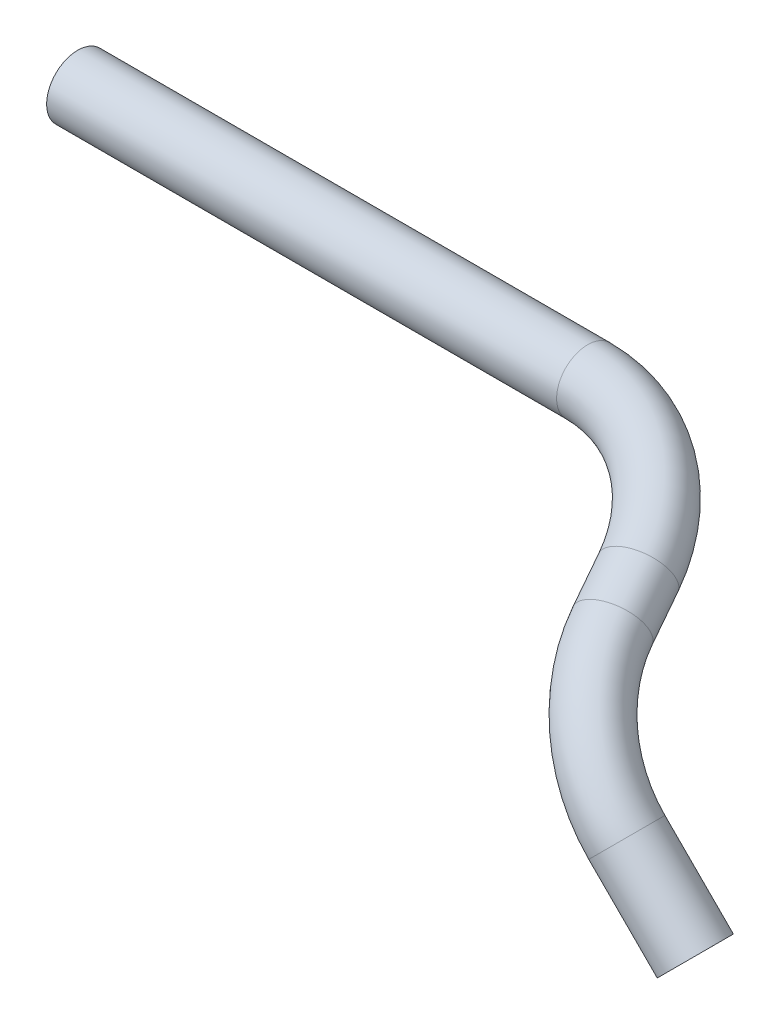
ISO-10303-21;
HEADER;
FILE_DESCRIPTION(('STEP AP214'),'2;1');
FILE_NAME('part.step','',(''),(''),'','','');
FILE_SCHEMA(('AUTOMOTIVE_DESIGN { 1 0 10303 214 1 1 1 1 }'));
ENDSEC;
DATA;
#1=APPLICATION_CONTEXT('core data for automotive mechanical design processes');
#2=APPLICATION_PROTOCOL_DEFINITION('international standard','automotive_design',2000,#1);
#3=PRODUCT_CONTEXT('',#1,'mechanical');
#4=PRODUCT('Part','Part','',(#3));
#5=PRODUCT_RELATED_PRODUCT_CATEGORY('part','',(#4));
#6=PRODUCT_DEFINITION_FORMATION('','',#4);
#7=PRODUCT_DEFINITION_CONTEXT('part definition',#1,'design');
#8=PRODUCT_DEFINITION('design','',#6,#7);
#9=PRODUCT_DEFINITION_SHAPE('','',#8);
#10=(LENGTH_UNIT() NAMED_UNIT(*) SI_UNIT(.MILLI.,.METRE.));
#11=(NAMED_UNIT(*) PLANE_ANGLE_UNIT() SI_UNIT($,.RADIAN.));
#12=(NAMED_UNIT(*) SI_UNIT($,.STERADIAN.) SOLID_ANGLE_UNIT());
#13=UNCERTAINTY_MEASURE_WITH_UNIT(LENGTH_MEASURE(1.E-05),#10,'distance_accuracy_value','');
#14=(GEOMETRIC_REPRESENTATION_CONTEXT(3) GLOBAL_UNCERTAINTY_ASSIGNED_CONTEXT((#13)) GLOBAL_UNIT_ASSIGNED_CONTEXT((#10,
#11,#12)) REPRESENTATION_CONTEXT('',''));
#15=CARTESIAN_POINT('',(0.,0.,0.));
#16=DIRECTION('',(0.,0.,1.));
#17=DIRECTION('',(1.,0.,0.));
#18=AXIS2_PLACEMENT_3D('',#15,#16,#17);
#19=CARTESIAN_POINT('',(0.,0.,0.));
#20=DIRECTION('',(0.707106781186546,-0.707106781186549,0.));
#21=DIRECTION('',(0.628693194646936,0.628693194646934,0.457700485043726));
#22=AXIS2_PLACEMENT_3D('',#19,#20,#21);
#23=PLANE('',#22);
#24=CARTESIAN_POINT('',(0.,0.,0.));
#25=DIRECTION('',(0.707106781186546,-0.707106781186549,0.));
#26=DIRECTION('',(0.628693194646936,0.628693194646934,0.457700485043726));
#27=AXIS2_PLACEMENT_3D('',#24,#25,#26);
#28=CIRCLE('',#27,12.7);
#29=CARTESIAN_POINT('',(7.98440357201609,7.98440357201607,5.81279616005534));
#30=VERTEX_POINT('',#29);
#31=EDGE_CURVE('E73',#30,#30,#28,.T.);
#32=ORIENTED_EDGE('',*,*,#31,.T.);
#33=EDGE_LOOP('',(#32));
#34=FACE_BOUND('',#33,.T.);
#35=ADVANCED_FACE('F51',(#34),#23,.T.);
#36=CARTESIAN_POINT('',(-339.937127276248,93.6679951451349,-87.8182033578285));
#37=DIRECTION('',(1.,0.,0.));
#38=DIRECTION('',(0.,1.,0.));
#39=AXIS2_PLACEMENT_3D('',#36,#37,#38);
#40=PLANE('',#39);
#41=CARTESIAN_POINT('',(-339.937127276248,93.6679951451349,-87.8182033578285));
#42=DIRECTION('',(1.,0.,0.));
#43=DIRECTION('',(0.,1.,0.));
#44=AXIS2_PLACEMENT_3D('',#41,#42,#43);
#45=CIRCLE('',#44,12.7);
#46=CARTESIAN_POINT('',(-339.937127276248,106.367995145135,-87.8182033578285));
#47=VERTEX_POINT('',#46);
#48=EDGE_CURVE('E11',#47,#47,#45,.T.);
#49=ORIENTED_EDGE('',*,*,#48,.F.);
#50=EDGE_LOOP('',(#49));
#51=FACE_BOUND('',#50,.T.);
#52=ADVANCED_FACE('F81',(#51),#40,.F.);
#53=CARTESIAN_POINT('',(0.,0.,0.));
#54=DIRECTION('',(-0.707106781186546,0.707106781186549,0.));
#55=DIRECTION('',(-0.707106781186549,-0.707106781186546,0.));
#56=AXIS2_PLACEMENT_3D('',#53,#54,#55);
#57=CYLINDRICAL_SURFACE('',#56,12.7);
#58=CARTESIAN_POINT('',(-27.9577702819595,27.9577702819596,0.));
#59=DIRECTION('',(0.707106781186546,-0.707106781186549,0.));
#60=DIRECTION('',(0.628693194646936,0.628693194646934,0.457700485043726));
#61=AXIS2_PLACEMENT_3D('',#58,#59,#60);
#62=CIRCLE('',#61,12.7);
#63=CARTESIAN_POINT('',(-28.5156976126059,27.3998429513132,12.6754658370979));
#64=VERTEX_POINT('',#63);
#65=EDGE_CURVE('E70',#64,#64,#62,.T.);
#66=ORIENTED_EDGE('',*,*,#65,.T.);
#67=EDGE_LOOP('',(#66));
#68=FACE_BOUND('',#67,.T.);
#69=ORIENTED_EDGE('',*,*,#31,.F.);
#70=EDGE_LOOP('',(#69));
#71=FACE_BOUND('',#70,.T.);
#72=ADVANCED_FACE('F78',(#68,#71),#57,.T.);
#73=CARTESIAN_POINT('',(-25.1681336287275,30.7474069351916,-63.3773291854894));
#74=DIRECTION('',(-0.705740775441759,-0.705740775441758,-0.0621282203006888));
#75=DIRECTION('',(0.707106781186547,-0.707106781186548,0.));
#76=AXIS2_PLACEMENT_3D('',#73,#74,#75);
#77=TOROIDAL_SURFACE('',#76,63.5,12.7);
#78=CARTESIAN_POINT('',(-65.4486016220265,68.2382382752587,-31.6886645927449));
#79=DIRECTION('',(0.315507781002294,-0.39159900018425,0.864352395254218));
#80=DIRECTION('',(0.391599000184251,0.883429213297039,0.257299530019141));
#81=AXIS2_PLACEMENT_3D('',#78,#79,#80);
#82=CIRCLE('',#81,12.7);
#83=CARTESIAN_POINT('',(-73.5046952206863,75.7364045432721,-25.350931674196));
#84=VERTEX_POINT('',#83);
#85=EDGE_CURVE('E65',#84,#84,#82,.T.);
#86=CARTESIAN_POINT('',(-25.1681336287275,30.7474069351916,-63.3773291854894));
#87=DIRECTION('',(-0.705740775441759,-0.705740775441758,-0.0621282203006888));
#88=DIRECTION('',(0.707106781186547,-0.707106781186548,0.));
#89=AXIS2_PLACEMENT_3D('',#86,#87,#88);
#90=CIRCLE('',#89,76.2);
#91=EDGE_CURVE('',#64,#84,#90,.T.);
#92=ORIENTED_EDGE('',*,*,#65,.F.);
#93=ORIENTED_EDGE('',*,*,#85,.T.);
#94=ORIENTED_EDGE('',*,*,#91,.T.);
#95=ORIENTED_EDGE('',*,*,#91,.F.);
#96=EDGE_LOOP('',(#92,#94,#93,#95));
#97=FACE_BOUND('',#96,.T.);
#98=ADVANCED_FACE('F80',(#97),#77,.T.);
#99=CARTESIAN_POINT('',(-65.4486016220265,68.2382382752587,-31.6886645927449));
#100=DIRECTION('',(-0.315507781002294,0.39159900018425,-0.864352395254218));
#101=DIRECTION('',(0.,0.91087728378198,0.41267732417709));
#102=AXIS2_PLACEMENT_3D('',#99,#100,#101);
#103=CYLINDRICAL_SURFACE('',#102,12.7);
#104=CARTESIAN_POINT('',(-71.4853471080998,75.7308696430282,-48.2266891189599));
#105=DIRECTION('',(0.315507781002294,-0.39159900018425,0.864352395254218));
#106=DIRECTION('',(0.391599000184251,0.883429213297039,0.257299530019141));
#107=AXIS2_PLACEMENT_3D('',#104,#105,#106);
#108=CIRCLE('',#107,12.7);
#109=CARTESIAN_POINT('',(-59.4340251406107,77.3844465596559,-51.8765277752173));
#110=VERTEX_POINT('',#109);
#111=EDGE_CURVE('E61',#110,#110,#108,.T.);
#112=ORIENTED_EDGE('',*,*,#111,.T.);
#113=EDGE_LOOP('',(#112));
#114=FACE_BOUND('',#113,.T.);
#115=ORIENTED_EDGE('',*,*,#85,.F.);
#116=EDGE_LOOP('',(#115));
#117=FACE_BOUND('',#116,.T.);
#118=ADVANCED_FACE('F88',(#114,#117),#103,.T.);
#119=CARTESIAN_POINT('',(-131.741956945545,67.4629850598897,-29.9774958376728));
#120=DIRECTION('',(0.,0.91087728378198,0.41267732417709));
#121=DIRECTION('',(0.,-0.41267732417709,0.91087728378198));
#122=AXIS2_PLACEMENT_3D('',#119,#120,#121);
#123=TOROIDAL_SURFACE('',#122,63.4999999999999,12.7);
#124=CARTESIAN_POINT('',(-131.741956945545,93.667995145135,-87.8182033578285));
#125=DIRECTION('',(1.,0.,0.));
#126=DIRECTION('',(0.,1.,0.));
#127=AXIS2_PLACEMENT_3D('',#124,#125,#126);
#128=CIRCLE('',#127,12.7);
#129=CARTESIAN_POINT('',(-131.741956945545,98.908997162184,-99.3863448618596));
#130=VERTEX_POINT('',#129);
#131=EDGE_CURVE('E57',#130,#130,#128,.T.);
#132=CARTESIAN_POINT('',(-131.741956945545,67.4629850598897,-29.9774958376728));
#133=DIRECTION('',(0.,0.91087728378198,0.41267732417709));
#134=DIRECTION('',(0.,-0.41267732417709,0.91087728378198));
#135=AXIS2_PLACEMENT_3D('',#132,#133,#134);
#136=CIRCLE('',#135,76.1999999999999);
#137=EDGE_CURVE('',#110,#130,#136,.T.);
#138=ORIENTED_EDGE('',*,*,#111,.F.);
#139=ORIENTED_EDGE('',*,*,#131,.T.);
#140=ORIENTED_EDGE('',*,*,#137,.T.);
#141=ORIENTED_EDGE('',*,*,#137,.F.);
#142=EDGE_LOOP('',(#138,#140,#139,#141));
#143=FACE_BOUND('',#142,.T.);
#144=ADVANCED_FACE('F94',(#143),#123,.T.);
#145=CARTESIAN_POINT('',(-131.741956945545,93.6679951451349,-87.8182033578285));
#146=DIRECTION('',(-1.,0.,0.));
#147=DIRECTION('',(0.,-1.,0.));
#148=AXIS2_PLACEMENT_3D('',#145,#146,#147);
#149=CYLINDRICAL_SURFACE('',#148,12.7);
#150=ORIENTED_EDGE('',*,*,#48,.T.);
#151=EDGE_LOOP('',(#150));
#152=FACE_BOUND('',#151,.T.);
#153=ORIENTED_EDGE('',*,*,#131,.F.);
#154=EDGE_LOOP('',(#153));
#155=FACE_BOUND('',#154,.T.);
#156=ADVANCED_FACE('F92',(#152,#155),#149,.T.);
#157=CLOSED_SHELL('',(#35,#52,#72,#98,#118,#144,#156));
#158=MANIFOLD_SOLID_BREP('B2',#157);
#159=ADVANCED_BREP_SHAPE_REPRESENTATION('',(#18,#158),#14);
#160=SHAPE_DEFINITION_REPRESENTATION(#9,#159);
ENDSEC;
END-ISO-10303-21;
